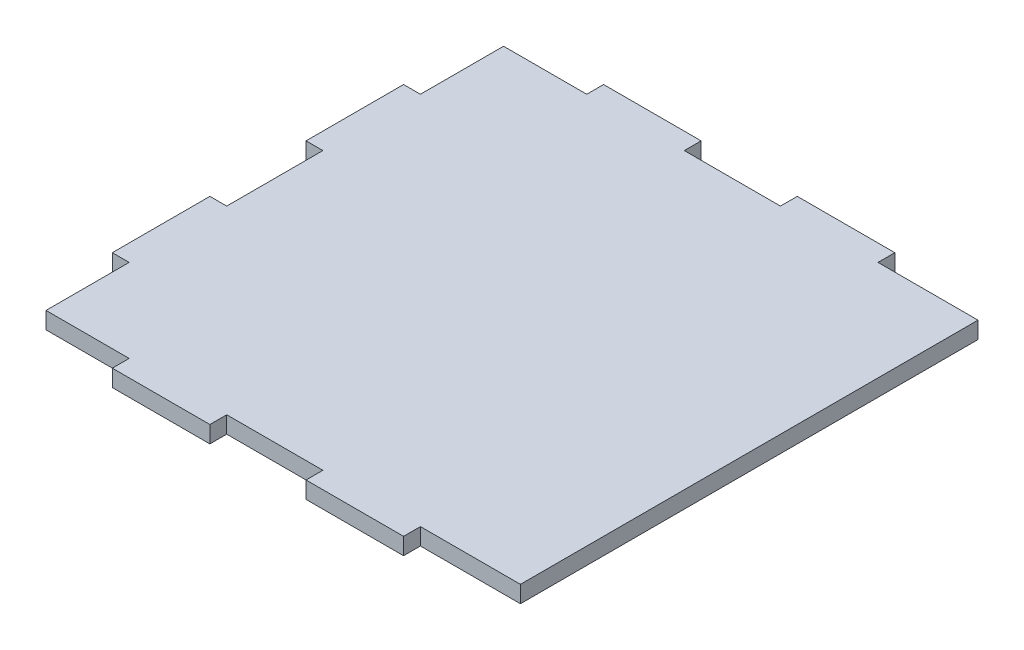
ISO-10303-21;
HEADER;
FILE_DESCRIPTION(('STEP AP214'),'2;1');
FILE_NAME('part.step','',(''),(''),'','','');
FILE_SCHEMA(('AUTOMOTIVE_DESIGN { 1 0 10303 214 1 1 1 1 }'));
ENDSEC;
DATA;
#1=APPLICATION_CONTEXT('core data for automotive mechanical design processes');
#2=APPLICATION_PROTOCOL_DEFINITION('international standard','automotive_design',2000,#1);
#3=PRODUCT_CONTEXT('',#1,'mechanical');
#4=PRODUCT('Part','Part','',(#3));
#5=PRODUCT_RELATED_PRODUCT_CATEGORY('part','',(#4));
#6=PRODUCT_DEFINITION_FORMATION('','',#4);
#7=PRODUCT_DEFINITION_CONTEXT('part definition',#1,'design');
#8=PRODUCT_DEFINITION('design','',#6,#7);
#9=PRODUCT_DEFINITION_SHAPE('','',#8);
#10=(LENGTH_UNIT() NAMED_UNIT(*) SI_UNIT(.MILLI.,.METRE.));
#11=(NAMED_UNIT(*) PLANE_ANGLE_UNIT() SI_UNIT($,.RADIAN.));
#12=(NAMED_UNIT(*) SI_UNIT($,.STERADIAN.) SOLID_ANGLE_UNIT());
#13=UNCERTAINTY_MEASURE_WITH_UNIT(LENGTH_MEASURE(1.E-05),#10,'distance_accuracy_value','');
#14=(GEOMETRIC_REPRESENTATION_CONTEXT(3) GLOBAL_UNCERTAINTY_ASSIGNED_CONTEXT((#13)) GLOBAL_UNIT_ASSIGNED_CONTEXT((#10,
#11,#12)) REPRESENTATION_CONTEXT('',''));
#15=CARTESIAN_POINT('',(0.,0.,0.));
#16=DIRECTION('',(0.,0.,1.));
#17=DIRECTION('',(1.,0.,0.));
#18=AXIS2_PLACEMENT_3D('',#15,#16,#17);
#19=CARTESIAN_POINT('',(12.0000000000001,12.,0.));
#20=DIRECTION('',(-1.,0.,0.));
#21=DIRECTION('',(0.,0.,1.));
#22=AXIS2_PLACEMENT_3D('',#19,#20,#21);
#23=PLANE('',#22);
#24=DIRECTION('',(0.,0.,-1.));
#25=VECTOR('',#24,1.);
#26=CARTESIAN_POINT('',(12.0000000000001,0.,0.));
#27=LINE('',#26,#25);
#28=CARTESIAN_POINT('',(12.0000000000001,0.,-12.0000000000001));
#29=VERTEX_POINT('',#28);
#30=CARTESIAN_POINT('',(12.0000000000001,0.,-71.25));
#31=VERTEX_POINT('',#30);
#32=EDGE_CURVE('E252',#29,#31,#27,.T.);
#33=ORIENTED_EDGE('',*,*,#32,.F.);
#34=DIRECTION('',(0.,-1.,0.));
#35=VECTOR('',#34,1.);
#36=CARTESIAN_POINT('',(12.0000000000001,12.,-12.0000000000001));
#37=LINE('',#36,#35);
#38=CARTESIAN_POINT('',(12.0000000000001,12.,-12.0000000000001));
#39=VERTEX_POINT('',#38);
#40=EDGE_CURVE('E11',#39,#29,#37,.T.);
#41=ORIENTED_EDGE('',*,*,#40,.F.);
#42=DIRECTION('',(0.,0.,-1.));
#43=VECTOR('',#42,1.);
#44=CARTESIAN_POINT('',(12.0000000000001,12.,0.));
#45=LINE('',#44,#43);
#46=CARTESIAN_POINT('',(12.0000000000001,12.,-71.25));
#47=VERTEX_POINT('',#46);
#48=EDGE_CURVE('E327',#39,#47,#45,.T.);
#49=ORIENTED_EDGE('',*,*,#48,.T.);
#50=DIRECTION('',(0.,-1.,0.));
#51=VECTOR('',#50,1.);
#52=CARTESIAN_POINT('',(12.0000000000001,12.,-71.25));
#53=LINE('',#52,#51);
#54=EDGE_CURVE('E149',#47,#31,#53,.T.);
#55=ORIENTED_EDGE('',*,*,#54,.T.);
#56=EDGE_LOOP('',(#33,#41,#49,#55));
#57=FACE_BOUND('',#56,.T.);
#58=ADVANCED_FACE('F39',(#57),#23,.T.);
#59=CARTESIAN_POINT('',(0.,12.,-12.0000000000001));
#60=DIRECTION('',(0.,0.,-1.));
#61=DIRECTION('',(-1.,0.,0.));
#62=AXIS2_PLACEMENT_3D('',#59,#60,#61);
#63=PLANE('',#62);
#64=DIRECTION('',(1.,0.,0.));
#65=VECTOR('',#64,1.);
#66=CARTESIAN_POINT('',(0.,0.,-12.0000000000001));
#67=LINE('',#66,#65);
#68=CARTESIAN_POINT('',(71.25,0.,-12.));
#69=VERTEX_POINT('',#68);
#70=EDGE_CURVE('E255',#29,#69,#67,.T.);
#71=ORIENTED_EDGE('',*,*,#70,.T.);
#72=DIRECTION('',(0.,-1.,0.));
#73=VECTOR('',#72,1.);
#74=CARTESIAN_POINT('',(71.25,12.,-12.));
#75=LINE('',#74,#73);
#76=CARTESIAN_POINT('',(71.25,12.,-12.));
#77=VERTEX_POINT('',#76);
#78=EDGE_CURVE('E47',#77,#69,#75,.T.);
#79=ORIENTED_EDGE('',*,*,#78,.F.);
#80=DIRECTION('',(1.,0.,0.));
#81=VECTOR('',#80,1.);
#82=CARTESIAN_POINT('',(0.,12.,-12.0000000000001));
#83=LINE('',#82,#81);
#84=EDGE_CURVE('E467',#39,#77,#83,.T.);
#85=ORIENTED_EDGE('',*,*,#84,.F.);
#86=ORIENTED_EDGE('',*,*,#40,.T.);
#87=EDGE_LOOP('',(#71,#79,#85,#86));
#88=FACE_BOUND('',#87,.T.);
#89=ADVANCED_FACE('F388',(#88),#63,.F.);
#90=CARTESIAN_POINT('',(71.25,12.,0.));
#91=DIRECTION('',(-1.,0.,0.));
#92=DIRECTION('',(0.,0.,1.));
#93=AXIS2_PLACEMENT_3D('',#90,#91,#92);
#94=PLANE('',#93);
#95=DIRECTION('',(0.,0.,-1.));
#96=VECTOR('',#95,1.);
#97=CARTESIAN_POINT('',(71.25,0.,0.));
#98=LINE('',#97,#96);
#99=CARTESIAN_POINT('',(71.25,0.,0.));
#100=VERTEX_POINT('',#99);
#101=EDGE_CURVE('E258',#100,#69,#98,.T.);
#102=ORIENTED_EDGE('',*,*,#101,.F.);
#103=DIRECTION('',(0.,-1.,0.));
#104=VECTOR('',#103,1.);
#105=CARTESIAN_POINT('',(71.25,12.,0.));
#106=LINE('',#105,#104);
#107=CARTESIAN_POINT('',(71.25,12.,0.));
#108=VERTEX_POINT('',#107);
#109=EDGE_CURVE('E378',#108,#100,#106,.T.);
#110=ORIENTED_EDGE('',*,*,#109,.F.);
#111=DIRECTION('',(0.,0.,-1.));
#112=VECTOR('',#111,1.);
#113=CARTESIAN_POINT('',(71.25,12.,0.));
#114=LINE('',#113,#112);
#115=EDGE_CURVE('E385',#108,#77,#114,.T.);
#116=ORIENTED_EDGE('',*,*,#115,.T.);
#117=ORIENTED_EDGE('',*,*,#78,.T.);
#118=EDGE_LOOP('',(#102,#110,#116,#117));
#119=FACE_BOUND('',#118,.T.);
#120=ADVANCED_FACE('F383',(#119),#94,.T.);
#121=CARTESIAN_POINT('',(0.,12.,0.));
#122=DIRECTION('',(0.,0.,-1.));
#123=DIRECTION('',(-1.,0.,0.));
#124=AXIS2_PLACEMENT_3D('',#121,#122,#123);
#125=PLANE('',#124);
#126=DIRECTION('',(1.,0.,0.));
#127=VECTOR('',#126,1.);
#128=CARTESIAN_POINT('',(0.,0.,0.));
#129=LINE('',#128,#127);
#130=CARTESIAN_POINT('',(140.75,0.,-1.12420065263303E-13));
#131=VERTEX_POINT('',#130);
#132=EDGE_CURVE('E261',#100,#131,#129,.T.);
#133=ORIENTED_EDGE('',*,*,#132,.T.);
#134=DIRECTION('',(0.,-1.,0.));
#135=VECTOR('',#134,1.);
#136=CARTESIAN_POINT('',(140.75,12.,-1.12420065263303E-13));
#137=LINE('',#136,#135);
#138=CARTESIAN_POINT('',(140.75,12.,-1.12420065263303E-13));
#139=VERTEX_POINT('',#138);
#140=EDGE_CURVE('E375',#139,#131,#137,.T.);
#141=ORIENTED_EDGE('',*,*,#140,.F.);
#142=DIRECTION('',(1.,0.,0.));
#143=VECTOR('',#142,1.);
#144=CARTESIAN_POINT('',(0.,12.,0.));
#145=LINE('',#144,#143);
#146=EDGE_CURVE('E405',#108,#139,#145,.T.);
#147=ORIENTED_EDGE('',*,*,#146,.F.);
#148=ORIENTED_EDGE('',*,*,#109,.T.);
#149=EDGE_LOOP('',(#133,#141,#147,#148));
#150=FACE_BOUND('',#149,.T.);
#151=ADVANCED_FACE('F396',(#150),#125,.F.);
#152=CARTESIAN_POINT('',(140.75,12.,0.));
#153=DIRECTION('',(-1.,0.,0.));
#154=DIRECTION('',(0.,0.,1.));
#155=AXIS2_PLACEMENT_3D('',#152,#153,#154);
#156=PLANE('',#155);
#157=DIRECTION('',(0.,0.,-1.));
#158=VECTOR('',#157,1.);
#159=CARTESIAN_POINT('',(140.75,0.,0.));
#160=LINE('',#159,#158);
#161=CARTESIAN_POINT('',(140.75,0.,-12.0000000000001));
#162=VERTEX_POINT('',#161);
#163=EDGE_CURVE('E263',#131,#162,#160,.T.);
#164=ORIENTED_EDGE('',*,*,#163,.T.);
#165=DIRECTION('',(0.,-1.,0.));
#166=VECTOR('',#165,1.);
#167=CARTESIAN_POINT('',(140.75,12.,-12.0000000000001));
#168=LINE('',#167,#166);
#169=CARTESIAN_POINT('',(140.75,12.,-12.0000000000001));
#170=VERTEX_POINT('',#169);
#171=EDGE_CURVE('E372',#170,#162,#168,.T.);
#172=ORIENTED_EDGE('',*,*,#171,.F.);
#173=DIRECTION('',(0.,0.,-1.));
#174=VECTOR('',#173,1.);
#175=CARTESIAN_POINT('',(140.75,12.,0.));
#176=LINE('',#175,#174);
#177=EDGE_CURVE('E402',#139,#170,#176,.T.);
#178=ORIENTED_EDGE('',*,*,#177,.F.);
#179=ORIENTED_EDGE('',*,*,#140,.T.);
#180=EDGE_LOOP('',(#164,#172,#178,#179));
#181=FACE_BOUND('',#180,.T.);
#182=ADVANCED_FACE('F400',(#181),#156,.F.);
#183=CARTESIAN_POINT('',(0.,12.,-12.0000000000001));
#184=DIRECTION('',(0.,0.,-1.));
#185=DIRECTION('',(-1.,0.,0.));
#186=AXIS2_PLACEMENT_3D('',#183,#184,#185);
#187=PLANE('',#186);
#188=DIRECTION('',(1.,0.,0.));
#189=VECTOR('',#188,1.);
#190=CARTESIAN_POINT('',(0.,0.,-12.0000000000001));
#191=LINE('',#190,#189);
#192=CARTESIAN_POINT('',(209.25,0.,-12.0000000000001));
#193=VERTEX_POINT('',#192);
#194=EDGE_CURVE('E265',#162,#193,#191,.T.);
#195=ORIENTED_EDGE('',*,*,#194,.T.);
#196=DIRECTION('',(0.,-1.,0.));
#197=VECTOR('',#196,1.);
#198=CARTESIAN_POINT('',(209.25,12.,-12.0000000000001));
#199=LINE('',#198,#197);
#200=CARTESIAN_POINT('',(209.25,12.,-12.0000000000001));
#201=VERTEX_POINT('',#200);
#202=EDGE_CURVE('E370',#201,#193,#199,.T.);
#203=ORIENTED_EDGE('',*,*,#202,.F.);
#204=DIRECTION('',(1.,0.,0.));
#205=VECTOR('',#204,1.);
#206=CARTESIAN_POINT('',(0.,12.,-12.0000000000001));
#207=LINE('',#206,#205);
#208=EDGE_CURVE('E404',#170,#201,#207,.T.);
#209=ORIENTED_EDGE('',*,*,#208,.F.);
#210=ORIENTED_EDGE('',*,*,#171,.T.);
#211=EDGE_LOOP('',(#195,#203,#209,#210));
#212=FACE_BOUND('',#211,.T.);
#213=ADVANCED_FACE('F483',(#212),#187,.F.);
#214=CARTESIAN_POINT('',(209.25,12.,0.));
#215=DIRECTION('',(-1.,0.,0.));
#216=DIRECTION('',(0.,0.,1.));
#217=AXIS2_PLACEMENT_3D('',#214,#215,#216);
#218=PLANE('',#217);
#219=DIRECTION('',(0.,0.,-1.));
#220=VECTOR('',#219,1.);
#221=CARTESIAN_POINT('',(209.25,0.,0.));
#222=LINE('',#221,#220);
#223=CARTESIAN_POINT('',(209.25,0.,-1.11022302462516E-13));
#224=VERTEX_POINT('',#223);
#225=EDGE_CURVE('E268',#224,#193,#222,.T.);
#226=ORIENTED_EDGE('',*,*,#225,.F.);
#227=DIRECTION('',(0.,-1.,0.));
#228=VECTOR('',#227,1.);
#229=CARTESIAN_POINT('',(209.25,12.,-1.11022302462516E-13));
#230=LINE('',#229,#228);
#231=CARTESIAN_POINT('',(209.25,12.,-1.11022302462516E-13));
#232=VERTEX_POINT('',#231);
#233=EDGE_CURVE('E368',#232,#224,#230,.T.);
#234=ORIENTED_EDGE('',*,*,#233,.F.);
#235=DIRECTION('',(0.,0.,-1.));
#236=VECTOR('',#235,1.);
#237=CARTESIAN_POINT('',(209.25,12.,0.));
#238=LINE('',#237,#236);
#239=EDGE_CURVE('E407',#232,#201,#238,.T.);
#240=ORIENTED_EDGE('',*,*,#239,.T.);
#241=ORIENTED_EDGE('',*,*,#202,.T.);
#242=EDGE_LOOP('',(#226,#234,#240,#241));
#243=FACE_BOUND('',#242,.T.);
#244=ADVANCED_FACE('F486',(#243),#218,.T.);
#245=CARTESIAN_POINT('',(0.,12.,0.));
#246=DIRECTION('',(0.,0.,-1.));
#247=DIRECTION('',(-1.,0.,0.));
#248=AXIS2_PLACEMENT_3D('',#245,#246,#247);
#249=PLANE('',#248);
#250=DIRECTION('',(1.,0.,0.));
#251=VECTOR('',#250,1.);
#252=CARTESIAN_POINT('',(0.,0.,0.));
#253=LINE('',#252,#251);
#254=CARTESIAN_POINT('',(278.75,0.,-1.11022302462516E-13));
#255=VERTEX_POINT('',#254);
#256=EDGE_CURVE('E271',#224,#255,#253,.T.);
#257=ORIENTED_EDGE('',*,*,#256,.T.);
#258=DIRECTION('',(0.,-1.,0.));
#259=VECTOR('',#258,1.);
#260=CARTESIAN_POINT('',(278.75,12.,-1.11022302462516E-13));
#261=LINE('',#260,#259);
#262=CARTESIAN_POINT('',(278.75,12.,-1.11022302462516E-13));
#263=VERTEX_POINT('',#262);
#264=EDGE_CURVE('E365',#263,#255,#261,.T.);
#265=ORIENTED_EDGE('',*,*,#264,.F.);
#266=DIRECTION('',(1.,0.,0.));
#267=VECTOR('',#266,1.);
#268=CARTESIAN_POINT('',(0.,12.,0.));
#269=LINE('',#268,#267);
#270=EDGE_CURVE('E414',#232,#263,#269,.T.);
#271=ORIENTED_EDGE('',*,*,#270,.F.);
#272=ORIENTED_EDGE('',*,*,#233,.T.);
#273=EDGE_LOOP('',(#257,#265,#271,#272));
#274=FACE_BOUND('',#273,.T.);
#275=ADVANCED_FACE('F490',(#274),#249,.F.);
#276=CARTESIAN_POINT('',(278.75,12.,0.));
#277=DIRECTION('',(-1.,0.,0.));
#278=DIRECTION('',(0.,0.,1.));
#279=AXIS2_PLACEMENT_3D('',#276,#277,#278);
#280=PLANE('',#279);
#281=DIRECTION('',(0.,0.,-1.));
#282=VECTOR('',#281,1.);
#283=CARTESIAN_POINT('',(278.75,0.,0.));
#284=LINE('',#283,#282);
#285=CARTESIAN_POINT('',(278.75,0.,-12.));
#286=VERTEX_POINT('',#285);
#287=EDGE_CURVE('E273',#255,#286,#284,.T.);
#288=ORIENTED_EDGE('',*,*,#287,.T.);
#289=DIRECTION('',(0.,-1.,0.));
#290=VECTOR('',#289,1.);
#291=CARTESIAN_POINT('',(278.75,12.,-12.));
#292=LINE('',#291,#290);
#293=CARTESIAN_POINT('',(278.75,12.,-12.));
#294=VERTEX_POINT('',#293);
#295=EDGE_CURVE('E363',#294,#286,#292,.T.);
#296=ORIENTED_EDGE('',*,*,#295,.F.);
#297=DIRECTION('',(0.,0.,-1.));
#298=VECTOR('',#297,1.);
#299=CARTESIAN_POINT('',(278.75,12.,0.));
#300=LINE('',#299,#298);
#301=EDGE_CURVE('E416',#263,#294,#300,.T.);
#302=ORIENTED_EDGE('',*,*,#301,.F.);
#303=ORIENTED_EDGE('',*,*,#264,.T.);
#304=EDGE_LOOP('',(#288,#296,#302,#303));
#305=FACE_BOUND('',#304,.T.);
#306=ADVANCED_FACE('F494',(#305),#280,.F.);
#307=CARTESIAN_POINT('',(0.,12.,-12.));
#308=DIRECTION('',(0.,0.,1.));
#309=DIRECTION('',(1.,0.,0.));
#310=AXIS2_PLACEMENT_3D('',#307,#308,#309);
#311=PLANE('',#310);
#312=DIRECTION('',(-1.,0.,0.));
#313=VECTOR('',#312,1.);
#314=CARTESIAN_POINT('',(0.,0.,-12.));
#315=LINE('',#314,#313);
#316=CARTESIAN_POINT('',(350.,0.,-12.));
#317=VERTEX_POINT('',#316);
#318=EDGE_CURVE('E276',#317,#286,#315,.T.);
#319=ORIENTED_EDGE('',*,*,#318,.F.);
#320=DIRECTION('',(0.,-1.,0.));
#321=VECTOR('',#320,1.);
#322=CARTESIAN_POINT('',(350.,12.,-12.));
#323=LINE('',#322,#321);
#324=CARTESIAN_POINT('',(350.,12.,-12.));
#325=VERTEX_POINT('',#324);
#326=EDGE_CURVE('E361',#325,#317,#323,.T.);
#327=ORIENTED_EDGE('',*,*,#326,.F.);
#328=DIRECTION('',(-1.,0.,0.));
#329=VECTOR('',#328,1.);
#330=CARTESIAN_POINT('',(0.,12.,-12.));
#331=LINE('',#330,#329);
#332=EDGE_CURVE('E418',#325,#294,#331,.T.);
#333=ORIENTED_EDGE('',*,*,#332,.T.);
#334=ORIENTED_EDGE('',*,*,#295,.T.);
#335=EDGE_LOOP('',(#319,#327,#333,#334));
#336=FACE_BOUND('',#335,.T.);
#337=ADVANCED_FACE('F498',(#336),#311,.T.);
#338=CARTESIAN_POINT('',(350.,12.,0.));
#339=DIRECTION('',(-1.,0.,0.));
#340=DIRECTION('',(0.,0.,1.));
#341=AXIS2_PLACEMENT_3D('',#338,#339,#340);
#342=PLANE('',#341);
#343=DIRECTION('',(0.,0.,-1.));
#344=VECTOR('',#343,1.);
#345=CARTESIAN_POINT('',(350.,0.,0.));
#346=LINE('',#345,#344);
#347=CARTESIAN_POINT('',(350.,0.,-338.));
#348=VERTEX_POINT('',#347);
#349=EDGE_CURVE('E279',#317,#348,#346,.T.);
#350=ORIENTED_EDGE('',*,*,#349,.T.);
#351=DIRECTION('',(0.,-1.,0.));
#352=VECTOR('',#351,1.);
#353=CARTESIAN_POINT('',(350.,12.,-338.));
#354=LINE('',#353,#352);
#355=CARTESIAN_POINT('',(350.,12.,-338.));
#356=VERTEX_POINT('',#355);
#357=EDGE_CURVE('E358',#356,#348,#354,.T.);
#358=ORIENTED_EDGE('',*,*,#357,.F.);
#359=DIRECTION('',(0.,0.,-1.));
#360=VECTOR('',#359,1.);
#361=CARTESIAN_POINT('',(350.,12.,0.));
#362=LINE('',#361,#360);
#363=EDGE_CURVE('E421',#325,#356,#362,.T.);
#364=ORIENTED_EDGE('',*,*,#363,.F.);
#365=ORIENTED_EDGE('',*,*,#326,.T.);
#366=EDGE_LOOP('',(#350,#358,#364,#365));
#367=FACE_BOUND('',#366,.T.);
#368=ADVANCED_FACE('F502',(#367),#342,.F.);
#369=CARTESIAN_POINT('',(0.,12.,-338.));
#370=DIRECTION('',(0.,0.,1.));
#371=DIRECTION('',(1.,0.,0.));
#372=AXIS2_PLACEMENT_3D('',#369,#370,#371);
#373=PLANE('',#372);
#374=DIRECTION('',(-1.,0.,0.));
#375=VECTOR('',#374,1.);
#376=CARTESIAN_POINT('',(0.,0.,-338.));
#377=LINE('',#376,#375);
#378=CARTESIAN_POINT('',(278.75,0.,-338.));
#379=VERTEX_POINT('',#378);
#380=EDGE_CURVE('E281',#348,#379,#377,.T.);
#381=ORIENTED_EDGE('',*,*,#380,.T.);
#382=DIRECTION('',(0.,-1.,0.));
#383=VECTOR('',#382,1.);
#384=CARTESIAN_POINT('',(278.75,12.,-338.));
#385=LINE('',#384,#383);
#386=CARTESIAN_POINT('',(278.75,12.,-338.));
#387=VERTEX_POINT('',#386);
#388=EDGE_CURVE('E356',#387,#379,#385,.T.);
#389=ORIENTED_EDGE('',*,*,#388,.F.);
#390=DIRECTION('',(-1.,0.,0.));
#391=VECTOR('',#390,1.);
#392=CARTESIAN_POINT('',(0.,12.,-338.));
#393=LINE('',#392,#391);
#394=EDGE_CURVE('E423',#356,#387,#393,.T.);
#395=ORIENTED_EDGE('',*,*,#394,.F.);
#396=ORIENTED_EDGE('',*,*,#357,.T.);
#397=EDGE_LOOP('',(#381,#389,#395,#396));
#398=FACE_BOUND('',#397,.T.);
#399=ADVANCED_FACE('F506',(#398),#373,.F.);
#400=CARTESIAN_POINT('',(278.75,12.,0.));
#401=DIRECTION('',(1.,0.,0.));
#402=DIRECTION('',(0.,0.,-1.));
#403=AXIS2_PLACEMENT_3D('',#400,#401,#402);
#404=PLANE('',#403);
#405=DIRECTION('',(0.,0.,1.));
#406=VECTOR('',#405,1.);
#407=CARTESIAN_POINT('',(278.75,0.,0.));
#408=LINE('',#407,#406);
#409=CARTESIAN_POINT('',(278.75,0.,-350.));
#410=VERTEX_POINT('',#409);
#411=EDGE_CURVE('E284',#410,#379,#408,.T.);
#412=ORIENTED_EDGE('',*,*,#411,.F.);
#413=DIRECTION('',(0.,-1.,0.));
#414=VECTOR('',#413,1.);
#415=CARTESIAN_POINT('',(278.75,12.,-350.));
#416=LINE('',#415,#414);
#417=CARTESIAN_POINT('',(278.75,12.,-350.));
#418=VERTEX_POINT('',#417);
#419=EDGE_CURVE('E354',#418,#410,#416,.T.);
#420=ORIENTED_EDGE('',*,*,#419,.F.);
#421=DIRECTION('',(0.,0.,1.));
#422=VECTOR('',#421,1.);
#423=CARTESIAN_POINT('',(278.75,12.,0.));
#424=LINE('',#423,#422);
#425=EDGE_CURVE('E425',#418,#387,#424,.T.);
#426=ORIENTED_EDGE('',*,*,#425,.T.);
#427=ORIENTED_EDGE('',*,*,#388,.T.);
#428=EDGE_LOOP('',(#412,#420,#426,#427));
#429=FACE_BOUND('',#428,.T.);
#430=ADVANCED_FACE('F510',(#429),#404,.T.);
#431=CARTESIAN_POINT('',(0.,12.,-350.));
#432=DIRECTION('',(0.,0.,-1.));
#433=DIRECTION('',(-1.,0.,0.));
#434=AXIS2_PLACEMENT_3D('',#431,#432,#433);
#435=PLANE('',#434);
#436=DIRECTION('',(1.,0.,0.));
#437=VECTOR('',#436,1.);
#438=CARTESIAN_POINT('',(0.,0.,-350.));
#439=LINE('',#438,#437);
#440=CARTESIAN_POINT('',(209.25,0.,-350.));
#441=VERTEX_POINT('',#440);
#442=EDGE_CURVE('E287',#441,#410,#439,.T.);
#443=ORIENTED_EDGE('',*,*,#442,.F.);
#444=DIRECTION('',(0.,-1.,0.));
#445=VECTOR('',#444,1.);
#446=CARTESIAN_POINT('',(209.25,12.,-350.));
#447=LINE('',#446,#445);
#448=CARTESIAN_POINT('',(209.25,12.,-350.));
#449=VERTEX_POINT('',#448);
#450=EDGE_CURVE('E352',#449,#441,#447,.T.);
#451=ORIENTED_EDGE('',*,*,#450,.F.);
#452=DIRECTION('',(1.,0.,0.));
#453=VECTOR('',#452,1.);
#454=CARTESIAN_POINT('',(0.,12.,-350.));
#455=LINE('',#454,#453);
#456=EDGE_CURVE('E428',#449,#418,#455,.T.);
#457=ORIENTED_EDGE('',*,*,#456,.T.);
#458=ORIENTED_EDGE('',*,*,#419,.T.);
#459=EDGE_LOOP('',(#443,#451,#457,#458));
#460=FACE_BOUND('',#459,.T.);
#461=ADVANCED_FACE('F514',(#460),#435,.T.);
#462=CARTESIAN_POINT('',(209.25,12.,0.));
#463=DIRECTION('',(1.,0.,0.));
#464=DIRECTION('',(0.,0.,-1.));
#465=AXIS2_PLACEMENT_3D('',#462,#463,#464);
#466=PLANE('',#465);
#467=DIRECTION('',(0.,0.,1.));
#468=VECTOR('',#467,1.);
#469=CARTESIAN_POINT('',(209.25,0.,0.));
#470=LINE('',#469,#468);
#471=CARTESIAN_POINT('',(209.25,0.,-338.));
#472=VERTEX_POINT('',#471);
#473=EDGE_CURVE('E290',#441,#472,#470,.T.);
#474=ORIENTED_EDGE('',*,*,#473,.T.);
#475=DIRECTION('',(0.,-1.,0.));
#476=VECTOR('',#475,1.);
#477=CARTESIAN_POINT('',(209.25,12.,-338.));
#478=LINE('',#477,#476);
#479=CARTESIAN_POINT('',(209.25,12.,-338.));
#480=VERTEX_POINT('',#479);
#481=EDGE_CURVE('E350',#480,#472,#478,.T.);
#482=ORIENTED_EDGE('',*,*,#481,.F.);
#483=DIRECTION('',(0.,0.,1.));
#484=VECTOR('',#483,1.);
#485=CARTESIAN_POINT('',(209.25,12.,0.));
#486=LINE('',#485,#484);
#487=EDGE_CURVE('E431',#449,#480,#486,.T.);
#488=ORIENTED_EDGE('',*,*,#487,.F.);
#489=ORIENTED_EDGE('',*,*,#450,.T.);
#490=EDGE_LOOP('',(#474,#482,#488,#489));
#491=FACE_BOUND('',#490,.T.);
#492=ADVANCED_FACE('F518',(#491),#466,.F.);
#493=CARTESIAN_POINT('',(0.,12.,-338.));
#494=DIRECTION('',(0.,0.,-1.));
#495=DIRECTION('',(-1.,0.,0.));
#496=AXIS2_PLACEMENT_3D('',#493,#494,#495);
#497=PLANE('',#496);
#498=DIRECTION('',(1.,0.,0.));
#499=VECTOR('',#498,1.);
#500=CARTESIAN_POINT('',(0.,0.,-338.));
#501=LINE('',#500,#499);
#502=CARTESIAN_POINT('',(140.75,0.,-338.));
#503=VERTEX_POINT('',#502);
#504=EDGE_CURVE('E293',#503,#472,#501,.T.);
#505=ORIENTED_EDGE('',*,*,#504,.F.);
#506=DIRECTION('',(0.,-1.,0.));
#507=VECTOR('',#506,1.);
#508=CARTESIAN_POINT('',(140.75,12.,-338.));
#509=LINE('',#508,#507);
#510=CARTESIAN_POINT('',(140.75,12.,-338.));
#511=VERTEX_POINT('',#510);
#512=EDGE_CURVE('E348',#511,#503,#509,.T.);
#513=ORIENTED_EDGE('',*,*,#512,.F.);
#514=DIRECTION('',(1.,0.,0.));
#515=VECTOR('',#514,1.);
#516=CARTESIAN_POINT('',(0.,12.,-338.));
#517=LINE('',#516,#515);
#518=EDGE_CURVE('E433',#511,#480,#517,.T.);
#519=ORIENTED_EDGE('',*,*,#518,.T.);
#520=ORIENTED_EDGE('',*,*,#481,.T.);
#521=EDGE_LOOP('',(#505,#513,#519,#520));
#522=FACE_BOUND('',#521,.T.);
#523=ADVANCED_FACE('F522',(#522),#497,.T.);
#524=CARTESIAN_POINT('',(140.75,12.,0.));
#525=DIRECTION('',(1.,0.,0.));
#526=DIRECTION('',(0.,0.,-1.));
#527=AXIS2_PLACEMENT_3D('',#524,#525,#526);
#528=PLANE('',#527);
#529=DIRECTION('',(0.,0.,1.));
#530=VECTOR('',#529,1.);
#531=CARTESIAN_POINT('',(140.75,0.,0.));
#532=LINE('',#531,#530);
#533=CARTESIAN_POINT('',(140.75,0.,-350.));
#534=VERTEX_POINT('',#533);
#535=EDGE_CURVE('E296',#534,#503,#532,.T.);
#536=ORIENTED_EDGE('',*,*,#535,.F.);
#537=DIRECTION('',(0.,-1.,0.));
#538=VECTOR('',#537,1.);
#539=CARTESIAN_POINT('',(140.75,12.,-350.));
#540=LINE('',#539,#538);
#541=CARTESIAN_POINT('',(140.75,12.,-350.));
#542=VERTEX_POINT('',#541);
#543=EDGE_CURVE('E346',#542,#534,#540,.T.);
#544=ORIENTED_EDGE('',*,*,#543,.F.);
#545=DIRECTION('',(0.,0.,1.));
#546=VECTOR('',#545,1.);
#547=CARTESIAN_POINT('',(140.75,12.,0.));
#548=LINE('',#547,#546);
#549=EDGE_CURVE('E436',#542,#511,#548,.T.);
#550=ORIENTED_EDGE('',*,*,#549,.T.);
#551=ORIENTED_EDGE('',*,*,#512,.T.);
#552=EDGE_LOOP('',(#536,#544,#550,#551));
#553=FACE_BOUND('',#552,.T.);
#554=ADVANCED_FACE('F526',(#553),#528,.T.);
#555=CARTESIAN_POINT('',(0.,12.,-350.));
#556=DIRECTION('',(0.,0.,-1.));
#557=DIRECTION('',(-1.,0.,0.));
#558=AXIS2_PLACEMENT_3D('',#555,#556,#557);
#559=PLANE('',#558);
#560=DIRECTION('',(1.,0.,0.));
#561=VECTOR('',#560,1.);
#562=CARTESIAN_POINT('',(0.,0.,-350.));
#563=LINE('',#562,#561);
#564=CARTESIAN_POINT('',(71.25,0.,-350.));
#565=VERTEX_POINT('',#564);
#566=EDGE_CURVE('E299',#565,#534,#563,.T.);
#567=ORIENTED_EDGE('',*,*,#566,.F.);
#568=DIRECTION('',(0.,-1.,0.));
#569=VECTOR('',#568,1.);
#570=CARTESIAN_POINT('',(71.25,12.,-350.));
#571=LINE('',#570,#569);
#572=CARTESIAN_POINT('',(71.25,12.,-350.));
#573=VERTEX_POINT('',#572);
#574=EDGE_CURVE('E344',#573,#565,#571,.T.);
#575=ORIENTED_EDGE('',*,*,#574,.F.);
#576=DIRECTION('',(1.,0.,0.));
#577=VECTOR('',#576,1.);
#578=CARTESIAN_POINT('',(0.,12.,-350.));
#579=LINE('',#578,#577);
#580=EDGE_CURVE('E439',#573,#542,#579,.T.);
#581=ORIENTED_EDGE('',*,*,#580,.T.);
#582=ORIENTED_EDGE('',*,*,#543,.T.);
#583=EDGE_LOOP('',(#567,#575,#581,#582));
#584=FACE_BOUND('',#583,.T.);
#585=ADVANCED_FACE('F530',(#584),#559,.T.);
#586=CARTESIAN_POINT('',(71.25,12.,0.));
#587=DIRECTION('',(1.,0.,0.));
#588=DIRECTION('',(0.,0.,-1.));
#589=AXIS2_PLACEMENT_3D('',#586,#587,#588);
#590=PLANE('',#589);
#591=DIRECTION('',(0.,0.,1.));
#592=VECTOR('',#591,1.);
#593=CARTESIAN_POINT('',(71.25,0.,0.));
#594=LINE('',#593,#592);
#595=CARTESIAN_POINT('',(71.25,0.,-338.));
#596=VERTEX_POINT('',#595);
#597=EDGE_CURVE('E302',#565,#596,#594,.T.);
#598=ORIENTED_EDGE('',*,*,#597,.T.);
#599=DIRECTION('',(0.,-1.,0.));
#600=VECTOR('',#599,1.);
#601=CARTESIAN_POINT('',(71.25,12.,-338.));
#602=LINE('',#601,#600);
#603=CARTESIAN_POINT('',(71.25,12.,-338.));
#604=VERTEX_POINT('',#603);
#605=EDGE_CURVE('E342',#604,#596,#602,.T.);
#606=ORIENTED_EDGE('',*,*,#605,.F.);
#607=DIRECTION('',(0.,0.,1.));
#608=VECTOR('',#607,1.);
#609=CARTESIAN_POINT('',(71.25,12.,0.));
#610=LINE('',#609,#608);
#611=EDGE_CURVE('E442',#573,#604,#610,.T.);
#612=ORIENTED_EDGE('',*,*,#611,.F.);
#613=ORIENTED_EDGE('',*,*,#574,.T.);
#614=EDGE_LOOP('',(#598,#606,#612,#613));
#615=FACE_BOUND('',#614,.T.);
#616=ADVANCED_FACE('F534',(#615),#590,.F.);
#617=CARTESIAN_POINT('',(0.,12.,-338.));
#618=DIRECTION('',(0.,0.,-1.));
#619=DIRECTION('',(-1.,0.,0.));
#620=AXIS2_PLACEMENT_3D('',#617,#618,#619);
#621=PLANE('',#620);
#622=DIRECTION('',(1.,0.,0.));
#623=VECTOR('',#622,1.);
#624=CARTESIAN_POINT('',(0.,0.,-338.));
#625=LINE('',#624,#623);
#626=CARTESIAN_POINT('',(12.,0.,-338.));
#627=VERTEX_POINT('',#626);
#628=EDGE_CURVE('E305',#627,#596,#625,.T.);
#629=ORIENTED_EDGE('',*,*,#628,.F.);
#630=DIRECTION('',(0.,-1.,0.));
#631=VECTOR('',#630,1.);
#632=CARTESIAN_POINT('',(12.,12.,-338.));
#633=LINE('',#632,#631);
#634=CARTESIAN_POINT('',(12.,12.,-338.));
#635=VERTEX_POINT('',#634);
#636=EDGE_CURVE('E340',#635,#627,#633,.T.);
#637=ORIENTED_EDGE('',*,*,#636,.F.);
#638=DIRECTION('',(1.,0.,0.));
#639=VECTOR('',#638,1.);
#640=CARTESIAN_POINT('',(0.,12.,-338.));
#641=LINE('',#640,#639);
#642=EDGE_CURVE('E444',#635,#604,#641,.T.);
#643=ORIENTED_EDGE('',*,*,#642,.T.);
#644=ORIENTED_EDGE('',*,*,#605,.T.);
#645=EDGE_LOOP('',(#629,#637,#643,#644));
#646=FACE_BOUND('',#645,.T.);
#647=ADVANCED_FACE('F538',(#646),#621,.T.);
#648=CARTESIAN_POINT('',(12.0000000000001,12.,0.));
#649=DIRECTION('',(1.,0.,0.));
#650=DIRECTION('',(0.,0.,-1.));
#651=AXIS2_PLACEMENT_3D('',#648,#649,#650);
#652=PLANE('',#651);
#653=DIRECTION('',(0.,0.,1.));
#654=VECTOR('',#653,1.);
#655=CARTESIAN_POINT('',(12.0000000000001,0.,0.));
#656=LINE('',#655,#654);
#657=CARTESIAN_POINT('',(12.,0.,-278.75));
#658=VERTEX_POINT('',#657);
#659=EDGE_CURVE('E308',#627,#658,#656,.T.);
#660=ORIENTED_EDGE('',*,*,#659,.T.);
#661=DIRECTION('',(0.,-1.,0.));
#662=VECTOR('',#661,1.);
#663=CARTESIAN_POINT('',(12.,12.,-278.75));
#664=LINE('',#663,#662);
#665=CARTESIAN_POINT('',(12.,12.,-278.75));
#666=VERTEX_POINT('',#665);
#667=EDGE_CURVE('E338',#666,#658,#664,.T.);
#668=ORIENTED_EDGE('',*,*,#667,.F.);
#669=DIRECTION('',(0.,0.,1.));
#670=VECTOR('',#669,1.);
#671=CARTESIAN_POINT('',(12.0000000000001,12.,0.));
#672=LINE('',#671,#670);
#673=EDGE_CURVE('E447',#635,#666,#672,.T.);
#674=ORIENTED_EDGE('',*,*,#673,.F.);
#675=ORIENTED_EDGE('',*,*,#636,.T.);
#676=EDGE_LOOP('',(#660,#668,#674,#675));
#677=FACE_BOUND('',#676,.T.);
#678=ADVANCED_FACE('F542',(#677),#652,.F.);
#679=CARTESIAN_POINT('',(0.,12.,-278.75));
#680=DIRECTION('',(0.,0.,-1.));
#681=DIRECTION('',(-1.,0.,0.));
#682=AXIS2_PLACEMENT_3D('',#679,#680,#681);
#683=PLANE('',#682);
#684=DIRECTION('',(1.,0.,0.));
#685=VECTOR('',#684,1.);
#686=CARTESIAN_POINT('',(0.,0.,-278.75));
#687=LINE('',#686,#685);
#688=CARTESIAN_POINT('',(0.,0.,-278.75));
#689=VERTEX_POINT('',#688);
#690=EDGE_CURVE('E311',#689,#658,#687,.T.);
#691=ORIENTED_EDGE('',*,*,#690,.F.);
#692=DIRECTION('',(0.,-1.,0.));
#693=VECTOR('',#692,1.);
#694=CARTESIAN_POINT('',(0.,12.,-278.75));
#695=LINE('',#694,#693);
#696=CARTESIAN_POINT('',(0.,12.,-278.75));
#697=VERTEX_POINT('',#696);
#698=EDGE_CURVE('E336',#697,#689,#695,.T.);
#699=ORIENTED_EDGE('',*,*,#698,.F.);
#700=DIRECTION('',(1.,0.,0.));
#701=VECTOR('',#700,1.);
#702=CARTESIAN_POINT('',(0.,12.,-278.75));
#703=LINE('',#702,#701);
#704=EDGE_CURVE('E449',#697,#666,#703,.T.);
#705=ORIENTED_EDGE('',*,*,#704,.T.);
#706=ORIENTED_EDGE('',*,*,#667,.T.);
#707=EDGE_LOOP('',(#691,#699,#705,#706));
#708=FACE_BOUND('',#707,.T.);
#709=ADVANCED_FACE('F546',(#708),#683,.T.);
#710=CARTESIAN_POINT('',(0.,12.,0.));
#711=DIRECTION('',(-1.,0.,0.));
#712=DIRECTION('',(0.,0.,1.));
#713=AXIS2_PLACEMENT_3D('',#710,#711,#712);
#714=PLANE('',#713);
#715=DIRECTION('',(0.,0.,-1.));
#716=VECTOR('',#715,1.);
#717=CARTESIAN_POINT('',(0.,0.,0.));
#718=LINE('',#717,#716);
#719=CARTESIAN_POINT('',(0.,0.,-209.25));
#720=VERTEX_POINT('',#719);
#721=EDGE_CURVE('E314',#720,#689,#718,.T.);
#722=ORIENTED_EDGE('',*,*,#721,.F.);
#723=DIRECTION('',(0.,-1.,0.));
#724=VECTOR('',#723,1.);
#725=CARTESIAN_POINT('',(0.,12.,-209.25));
#726=LINE('',#725,#724);
#727=CARTESIAN_POINT('',(0.,12.,-209.25));
#728=VERTEX_POINT('',#727);
#729=EDGE_CURVE('E334',#728,#720,#726,.T.);
#730=ORIENTED_EDGE('',*,*,#729,.F.);
#731=DIRECTION('',(0.,0.,-1.));
#732=VECTOR('',#731,1.);
#733=CARTESIAN_POINT('',(0.,12.,0.));
#734=LINE('',#733,#732);
#735=EDGE_CURVE('E452',#728,#697,#734,.T.);
#736=ORIENTED_EDGE('',*,*,#735,.T.);
#737=ORIENTED_EDGE('',*,*,#698,.T.);
#738=EDGE_LOOP('',(#722,#730,#736,#737));
#739=FACE_BOUND('',#738,.T.);
#740=ADVANCED_FACE('F550',(#739),#714,.T.);
#741=CARTESIAN_POINT('',(0.,12.,-209.25));
#742=DIRECTION('',(0.,0.,-1.));
#743=DIRECTION('',(-1.,0.,0.));
#744=AXIS2_PLACEMENT_3D('',#741,#742,#743);
#745=PLANE('',#744);
#746=DIRECTION('',(1.,0.,0.));
#747=VECTOR('',#746,1.);
#748=CARTESIAN_POINT('',(0.,0.,-209.25));
#749=LINE('',#748,#747);
#750=CARTESIAN_POINT('',(12.,0.,-209.25));
#751=VERTEX_POINT('',#750);
#752=EDGE_CURVE('E317',#720,#751,#749,.T.);
#753=ORIENTED_EDGE('',*,*,#752,.T.);
#754=DIRECTION('',(0.,-1.,0.));
#755=VECTOR('',#754,1.);
#756=CARTESIAN_POINT('',(12.,12.,-209.25));
#757=LINE('',#756,#755);
#758=CARTESIAN_POINT('',(12.,12.,-209.25));
#759=VERTEX_POINT('',#758);
#760=EDGE_CURVE('E331',#759,#751,#757,.T.);
#761=ORIENTED_EDGE('',*,*,#760,.F.);
#762=DIRECTION('',(1.,0.,0.));
#763=VECTOR('',#762,1.);
#764=CARTESIAN_POINT('',(0.,12.,-209.25));
#765=LINE('',#764,#763);
#766=EDGE_CURVE('E455',#728,#759,#765,.T.);
#767=ORIENTED_EDGE('',*,*,#766,.F.);
#768=ORIENTED_EDGE('',*,*,#729,.T.);
#769=EDGE_LOOP('',(#753,#761,#767,#768));
#770=FACE_BOUND('',#769,.T.);
#771=ADVANCED_FACE('F461',(#770),#745,.F.);
#772=CARTESIAN_POINT('',(12.0000000000001,12.,0.));
#773=DIRECTION('',(1.,0.,0.));
#774=DIRECTION('',(0.,0.,-1.));
#775=AXIS2_PLACEMENT_3D('',#772,#773,#774);
#776=PLANE('',#775);
#777=DIRECTION('',(0.,0.,1.));
#778=VECTOR('',#777,1.);
#779=CARTESIAN_POINT('',(12.0000000000001,0.,0.));
#780=LINE('',#779,#778);
#781=CARTESIAN_POINT('',(12.0000000000001,0.,-140.75));
#782=VERTEX_POINT('',#781);
#783=EDGE_CURVE('E319',#751,#782,#780,.T.);
#784=ORIENTED_EDGE('',*,*,#783,.T.);
#785=DIRECTION('',(0.,-1.,0.));
#786=VECTOR('',#785,1.);
#787=CARTESIAN_POINT('',(12.0000000000001,12.,-140.75));
#788=LINE('',#787,#786);
#789=CARTESIAN_POINT('',(12.0000000000001,12.,-140.75));
#790=VERTEX_POINT('',#789);
#791=EDGE_CURVE('E239',#790,#782,#788,.T.);
#792=ORIENTED_EDGE('',*,*,#791,.F.);
#793=DIRECTION('',(0.,0.,1.));
#794=VECTOR('',#793,1.);
#795=CARTESIAN_POINT('',(12.0000000000001,12.,0.));
#796=LINE('',#795,#794);
#797=EDGE_CURVE('E244',#759,#790,#796,.T.);
#798=ORIENTED_EDGE('',*,*,#797,.F.);
#799=ORIENTED_EDGE('',*,*,#760,.T.);
#800=EDGE_LOOP('',(#784,#792,#798,#799));
#801=FACE_BOUND('',#800,.T.);
#802=ADVANCED_FACE('F465',(#801),#776,.F.);
#803=CARTESIAN_POINT('',(0.,12.,-140.75));
#804=DIRECTION('',(0.,0.,-1.));
#805=DIRECTION('',(-1.,0.,0.));
#806=AXIS2_PLACEMENT_3D('',#803,#804,#805);
#807=PLANE('',#806);
#808=DIRECTION('',(1.,0.,0.));
#809=VECTOR('',#808,1.);
#810=CARTESIAN_POINT('',(0.,0.,-140.75));
#811=LINE('',#810,#809);
#812=CARTESIAN_POINT('',(0.,0.,-140.75));
#813=VERTEX_POINT('',#812);
#814=EDGE_CURVE('E234',#813,#782,#811,.T.);
#815=ORIENTED_EDGE('',*,*,#814,.F.);
#816=DIRECTION('',(0.,-1.,0.));
#817=VECTOR('',#816,1.);
#818=CARTESIAN_POINT('',(0.,12.,-140.75));
#819=LINE('',#818,#817);
#820=CARTESIAN_POINT('',(0.,12.,-140.75));
#821=VERTEX_POINT('',#820);
#822=EDGE_CURVE('E229',#821,#813,#819,.T.);
#823=ORIENTED_EDGE('',*,*,#822,.F.);
#824=DIRECTION('',(1.,0.,0.));
#825=VECTOR('',#824,1.);
#826=CARTESIAN_POINT('',(0.,12.,-140.75));
#827=LINE('',#826,#825);
#828=EDGE_CURVE('E232',#821,#790,#827,.T.);
#829=ORIENTED_EDGE('',*,*,#828,.T.);
#830=ORIENTED_EDGE('',*,*,#791,.T.);
#831=EDGE_LOOP('',(#815,#823,#829,#830));
#832=FACE_BOUND('',#831,.T.);
#833=ADVANCED_FACE('F231',(#832),#807,.T.);
#834=CARTESIAN_POINT('',(0.,12.,0.));
#835=DIRECTION('',(-1.,0.,0.));
#836=DIRECTION('',(0.,0.,1.));
#837=AXIS2_PLACEMENT_3D('',#834,#835,#836);
#838=PLANE('',#837);
#839=DIRECTION('',(0.,0.,-1.));
#840=VECTOR('',#839,1.);
#841=CARTESIAN_POINT('',(0.,0.,0.));
#842=LINE('',#841,#840);
#843=CARTESIAN_POINT('',(0.,0.,-71.25));
#844=VERTEX_POINT('',#843);
#845=EDGE_CURVE('E323',#844,#813,#842,.T.);
#846=ORIENTED_EDGE('',*,*,#845,.F.);
#847=DIRECTION('',(0.,-1.,0.));
#848=VECTOR('',#847,1.);
#849=CARTESIAN_POINT('',(0.,12.,-71.25));
#850=LINE('',#849,#848);
#851=CARTESIAN_POINT('',(0.,12.,-71.25));
#852=VERTEX_POINT('',#851);
#853=EDGE_CURVE('E142',#852,#844,#850,.T.);
#854=ORIENTED_EDGE('',*,*,#853,.F.);
#855=DIRECTION('',(0.,0.,-1.));
#856=VECTOR('',#855,1.);
#857=CARTESIAN_POINT('',(0.,12.,0.));
#858=LINE('',#857,#856);
#859=EDGE_CURVE('E242',#852,#821,#858,.T.);
#860=ORIENTED_EDGE('',*,*,#859,.T.);
#861=ORIENTED_EDGE('',*,*,#822,.T.);
#862=EDGE_LOOP('',(#846,#854,#860,#861));
#863=FACE_BOUND('',#862,.T.);
#864=ADVANCED_FACE('F247',(#863),#838,.T.);
#865=CARTESIAN_POINT('',(0.,12.,-71.25));
#866=DIRECTION('',(0.,0.,-1.));
#867=DIRECTION('',(-1.,0.,0.));
#868=AXIS2_PLACEMENT_3D('',#865,#866,#867);
#869=PLANE('',#868);
#870=DIRECTION('',(1.,0.,0.));
#871=VECTOR('',#870,1.);
#872=CARTESIAN_POINT('',(0.,0.,-71.25));
#873=LINE('',#872,#871);
#874=EDGE_CURVE('E325',#844,#31,#873,.T.);
#875=ORIENTED_EDGE('',*,*,#874,.T.);
#876=ORIENTED_EDGE('',*,*,#54,.F.);
#877=DIRECTION('',(1.,0.,0.));
#878=VECTOR('',#877,1.);
#879=CARTESIAN_POINT('',(0.,12.,-71.25));
#880=LINE('',#879,#878);
#881=EDGE_CURVE('E55',#852,#47,#880,.T.);
#882=ORIENTED_EDGE('',*,*,#881,.F.);
#883=ORIENTED_EDGE('',*,*,#853,.T.);
#884=EDGE_LOOP('',(#875,#876,#882,#883));
#885=FACE_BOUND('',#884,.T.);
#886=ADVANCED_FACE('F466',(#885),#869,.F.);
#887=CARTESIAN_POINT('',(0.,12.,0.));
#888=DIRECTION('',(0.,1.,0.));
#889=DIRECTION('',(0.,0.,1.));
#890=AXIS2_PLACEMENT_3D('',#887,#888,#889);
#891=PLANE('',#890);
#892=ORIENTED_EDGE('',*,*,#48,.F.);
#893=ORIENTED_EDGE('',*,*,#84,.T.);
#894=ORIENTED_EDGE('',*,*,#115,.F.);
#895=ORIENTED_EDGE('',*,*,#146,.T.);
#896=ORIENTED_EDGE('',*,*,#177,.T.);
#897=ORIENTED_EDGE('',*,*,#208,.T.);
#898=ORIENTED_EDGE('',*,*,#239,.F.);
#899=ORIENTED_EDGE('',*,*,#270,.T.);
#900=ORIENTED_EDGE('',*,*,#301,.T.);
#901=ORIENTED_EDGE('',*,*,#332,.F.);
#902=ORIENTED_EDGE('',*,*,#363,.T.);
#903=ORIENTED_EDGE('',*,*,#394,.T.);
#904=ORIENTED_EDGE('',*,*,#425,.F.);
#905=ORIENTED_EDGE('',*,*,#456,.F.);
#906=ORIENTED_EDGE('',*,*,#487,.T.);
#907=ORIENTED_EDGE('',*,*,#518,.F.);
#908=ORIENTED_EDGE('',*,*,#549,.F.);
#909=ORIENTED_EDGE('',*,*,#580,.F.);
#910=ORIENTED_EDGE('',*,*,#611,.T.);
#911=ORIENTED_EDGE('',*,*,#642,.F.);
#912=ORIENTED_EDGE('',*,*,#673,.T.);
#913=ORIENTED_EDGE('',*,*,#704,.F.);
#914=ORIENTED_EDGE('',*,*,#735,.F.);
#915=ORIENTED_EDGE('',*,*,#766,.T.);
#916=ORIENTED_EDGE('',*,*,#797,.T.);
#917=ORIENTED_EDGE('',*,*,#828,.F.);
#918=ORIENTED_EDGE('',*,*,#859,.F.);
#919=ORIENTED_EDGE('',*,*,#881,.T.);
#920=EDGE_LOOP('',(#892,#893,#894,#895,#896,#897,#898,#899,#900,#901,#902,#903,#904,#905,#906,
#907,#908,#909,#910,#911,#912,#913,#914,#915,#916,#917,#918,#919));
#921=FACE_BOUND('',#920,.T.);
#922=ADVANCED_FACE('F241',(#921),#891,.T.);
#923=CARTESIAN_POINT('',(0.,0.,0.));
#924=DIRECTION('',(0.,1.,0.));
#925=DIRECTION('',(0.,0.,1.));
#926=AXIS2_PLACEMENT_3D('',#923,#924,#925);
#927=PLANE('',#926);
#928=ORIENTED_EDGE('',*,*,#32,.T.);
#929=ORIENTED_EDGE('',*,*,#874,.F.);
#930=ORIENTED_EDGE('',*,*,#845,.T.);
#931=ORIENTED_EDGE('',*,*,#814,.T.);
#932=ORIENTED_EDGE('',*,*,#783,.F.);
#933=ORIENTED_EDGE('',*,*,#752,.F.);
#934=ORIENTED_EDGE('',*,*,#721,.T.);
#935=ORIENTED_EDGE('',*,*,#690,.T.);
#936=ORIENTED_EDGE('',*,*,#659,.F.);
#937=ORIENTED_EDGE('',*,*,#628,.T.);
#938=ORIENTED_EDGE('',*,*,#597,.F.);
#939=ORIENTED_EDGE('',*,*,#566,.T.);
#940=ORIENTED_EDGE('',*,*,#535,.T.);
#941=ORIENTED_EDGE('',*,*,#504,.T.);
#942=ORIENTED_EDGE('',*,*,#473,.F.);
#943=ORIENTED_EDGE('',*,*,#442,.T.);
#944=ORIENTED_EDGE('',*,*,#411,.T.);
#945=ORIENTED_EDGE('',*,*,#380,.F.);
#946=ORIENTED_EDGE('',*,*,#349,.F.);
#947=ORIENTED_EDGE('',*,*,#318,.T.);
#948=ORIENTED_EDGE('',*,*,#287,.F.);
#949=ORIENTED_EDGE('',*,*,#256,.F.);
#950=ORIENTED_EDGE('',*,*,#225,.T.);
#951=ORIENTED_EDGE('',*,*,#194,.F.);
#952=ORIENTED_EDGE('',*,*,#163,.F.);
#953=ORIENTED_EDGE('',*,*,#132,.F.);
#954=ORIENTED_EDGE('',*,*,#101,.T.);
#955=ORIENTED_EDGE('',*,*,#70,.F.);
#956=EDGE_LOOP('',(#928,#929,#930,#931,#932,#933,#934,#935,#936,#937,#938,#939,#940,#941,#942,
#943,#944,#945,#946,#947,#948,#949,#950,#951,#952,#953,#954,#955));
#957=FACE_BOUND('',#956,.T.);
#958=ADVANCED_FACE('F391',(#957),#927,.F.);
#959=CLOSED_SHELL('',(#58,#89,#120,#151,#182,#213,#244,#275,#306,#337,#368,#399,#430,#461,#492,
#523,#554,#585,#616,#647,#678,#709,#740,#771,#802,#833,#864,#886,#922,#958));
#960=MANIFOLD_SOLID_BREP('B2',#959);
#961=ADVANCED_BREP_SHAPE_REPRESENTATION('',(#18,#960),#14);
#962=SHAPE_DEFINITION_REPRESENTATION(#9,#961);
ENDSEC;
END-ISO-10303-21;
